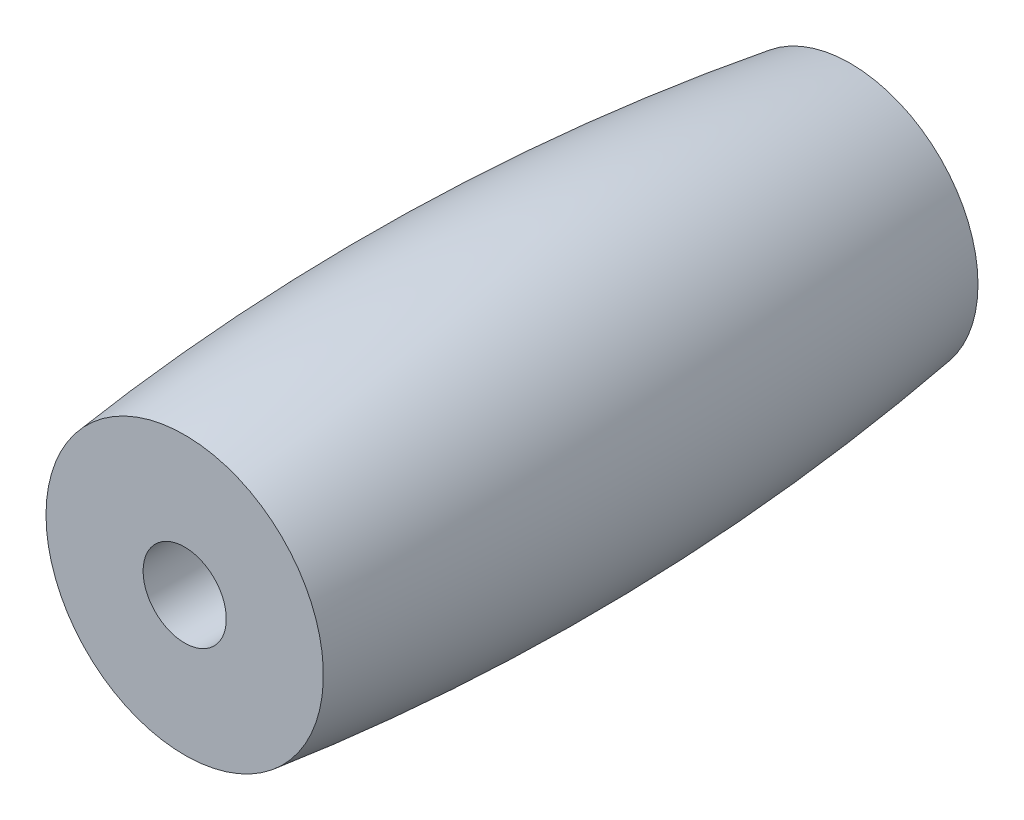
ISO-10303-21;
HEADER;
FILE_DESCRIPTION(('STEP AP214'),'2;1');
FILE_NAME('part.step','',(''),(''),'','','');
FILE_SCHEMA(('AUTOMOTIVE_DESIGN { 1 0 10303 214 1 1 1 1 }'));
ENDSEC;
DATA;
#1=APPLICATION_CONTEXT('core data for automotive mechanical design processes');
#2=APPLICATION_PROTOCOL_DEFINITION('international standard','automotive_design',2000,#1);
#3=PRODUCT_CONTEXT('',#1,'mechanical');
#4=PRODUCT('Part','Part','',(#3));
#5=PRODUCT_RELATED_PRODUCT_CATEGORY('part','',(#4));
#6=PRODUCT_DEFINITION_FORMATION('','',#4);
#7=PRODUCT_DEFINITION_CONTEXT('part definition',#1,'design');
#8=PRODUCT_DEFINITION('design','',#6,#7);
#9=PRODUCT_DEFINITION_SHAPE('','',#8);
#10=(LENGTH_UNIT() NAMED_UNIT(*) SI_UNIT(.MILLI.,.METRE.));
#11=(NAMED_UNIT(*) PLANE_ANGLE_UNIT() SI_UNIT($,.RADIAN.));
#12=(NAMED_UNIT(*) SI_UNIT($,.STERADIAN.) SOLID_ANGLE_UNIT());
#13=UNCERTAINTY_MEASURE_WITH_UNIT(LENGTH_MEASURE(1.E-05),#10,'distance_accuracy_value','');
#14=(GEOMETRIC_REPRESENTATION_CONTEXT(3) GLOBAL_UNCERTAINTY_ASSIGNED_CONTEXT((#13)) GLOBAL_UNIT_ASSIGNED_CONTEXT((#10,
#11,#12)) REPRESENTATION_CONTEXT('',''));
#15=CARTESIAN_POINT('',(0.,0.,0.));
#16=DIRECTION('',(0.,0.,1.));
#17=DIRECTION('',(1.,0.,0.));
#18=AXIS2_PLACEMENT_3D('',#15,#16,#17);
#19=CARTESIAN_POINT('',(0.,0.,54.));
#20=DIRECTION('',(0.,0.,-1.));
#21=DIRECTION('',(-1.,0.,0.));
#22=AXIS2_PLACEMENT_3D('',#19,#20,#21);
#23=CYLINDRICAL_SURFACE('',#22,2.38125);
#24=CARTESIAN_POINT('',(0.,0.,-40.6070987752124));
#25=DIRECTION('',(0.,0.,-1.));
#26=DIRECTION('',(-1.,0.,0.));
#27=AXIS2_PLACEMENT_3D('',#24,#25,#26);
#28=CIRCLE('',#27,2.38125);
#29=CARTESIAN_POINT('',(-2.38125,0.,-40.6070987752124));
#30=VERTEX_POINT('',#29);
#31=EDGE_CURVE('E18',#30,#30,#28,.F.);
#32=ORIENTED_EDGE('',*,*,#31,.F.);
#33=EDGE_LOOP('',(#32));
#34=FACE_BOUND('',#33,.T.);
#35=CARTESIAN_POINT('',(0.,0.,-2.50709877521237));
#36=DIRECTION('',(0.,0.,-1.));
#37=DIRECTION('',(-1.,0.,0.));
#38=AXIS2_PLACEMENT_3D('',#35,#36,#37);
#39=CIRCLE('',#38,2.38125);
#40=CARTESIAN_POINT('',(-2.38125,0.,-2.50709877521237));
#41=VERTEX_POINT('',#40);
#42=EDGE_CURVE('E27',#41,#41,#39,.T.);
#43=ORIENTED_EDGE('',*,*,#42,.F.);
#44=EDGE_LOOP('',(#43));
#45=FACE_BOUND('',#44,.T.);
#46=ADVANCED_FACE('F14',(#34,#45),#23,.F.);
#47=CARTESIAN_POINT('',(2.38125,0.,-40.6070987752124));
#48=DIRECTION('',(0.,0.,-1.));
#49=DIRECTION('',(-1.,0.,0.));
#50=AXIS2_PLACEMENT_3D('',#47,#48,#49);
#51=PLANE('',#50);
#52=ORIENTED_EDGE('',*,*,#31,.T.);
#53=EDGE_LOOP('',(#52));
#54=FACE_BOUND('',#53,.T.);
#55=CARTESIAN_POINT('',(-3.47869881049214E-13,-1.2755363034913E-13,-40.6070987752123));
#56=DIRECTION('',(0.,0.,-1.));
#57=DIRECTION('',(-1.,0.,0.));
#58=AXIS2_PLACEMENT_3D('',#55,#56,#57);
#59=CIRCLE('',#58,7.30249999999968);
#60=CARTESIAN_POINT('',(-7.30250000000003,-1.2755363034913E-13,-40.6070987752123));
#61=VERTEX_POINT('',#60);
#62=EDGE_CURVE('E22',#61,#61,#59,.F.);
#63=ORIENTED_EDGE('',*,*,#62,.F.);
#64=EDGE_LOOP('',(#63));
#65=FACE_BOUND('',#64,.T.);
#66=ADVANCED_FACE('F35',(#54,#65),#51,.T.);
#67=CARTESIAN_POINT('',(2.38125,0.,-2.50709877521235));
#68=DIRECTION('',(0.,0.,1.));
#69=DIRECTION('',(1.,0.,0.));
#70=AXIS2_PLACEMENT_3D('',#67,#68,#69);
#71=PLANE('',#70);
#72=ORIENTED_EDGE('',*,*,#42,.T.);
#73=EDGE_LOOP('',(#72));
#74=FACE_BOUND('',#73,.T.);
#75=CARTESIAN_POINT('',(-4.20275730481293E-13,-1.6375655506517E-13,-2.50709877521246));
#76=DIRECTION('',(0.,0.,-1.));
#77=DIRECTION('',(-1.,0.,0.));
#78=AXIS2_PLACEMENT_3D('',#75,#76,#77);
#79=CIRCLE('',#78,7.93749999999963);
#80=CARTESIAN_POINT('',(-7.93750000000005,-1.6375655506517E-13,-2.50709877521247));
#81=VERTEX_POINT('',#80);
#82=EDGE_CURVE('E9',#81,#81,#79,.T.);
#83=ORIENTED_EDGE('',*,*,#82,.F.);
#84=EDGE_LOOP('',(#83));
#85=FACE_BOUND('',#84,.T.);
#86=ADVANCED_FACE('F44',(#74,#85),#71,.T.);
#87=CARTESIAN_POINT('',(-3.88578058618805E-13,-1.47907719133926E-13,-19.1864321085459));
#88=DIRECTION('',(0.,0.,-1.));
#89=DIRECTION('',(-1.,0.,0.));
#90=AXIS2_PLACEMENT_3D('',#87,#88,#89);
#91=DEGENERATE_TOROIDAL_SURFACE('',#90,134.620000000002,143.529930560475,.F.);
#92=ORIENTED_EDGE('',*,*,#82,.T.);
#93=EDGE_LOOP('',(#92));
#94=FACE_BOUND('',#93,.T.);
#95=ORIENTED_EDGE('',*,*,#62,.T.);
#96=EDGE_LOOP('',(#95));
#97=FACE_BOUND('',#96,.T.);
#98=ADVANCED_FACE('F16',(#94,#97),#91,.F.);
#99=CLOSED_SHELL('',(#46,#66,#86,#98));
#100=MANIFOLD_SOLID_BREP('B1',#99);
#101=ADVANCED_BREP_SHAPE_REPRESENTATION('',(#18,#100),#14);
#102=SHAPE_DEFINITION_REPRESENTATION(#9,#101);
ENDSEC;
END-ISO-10303-21;
